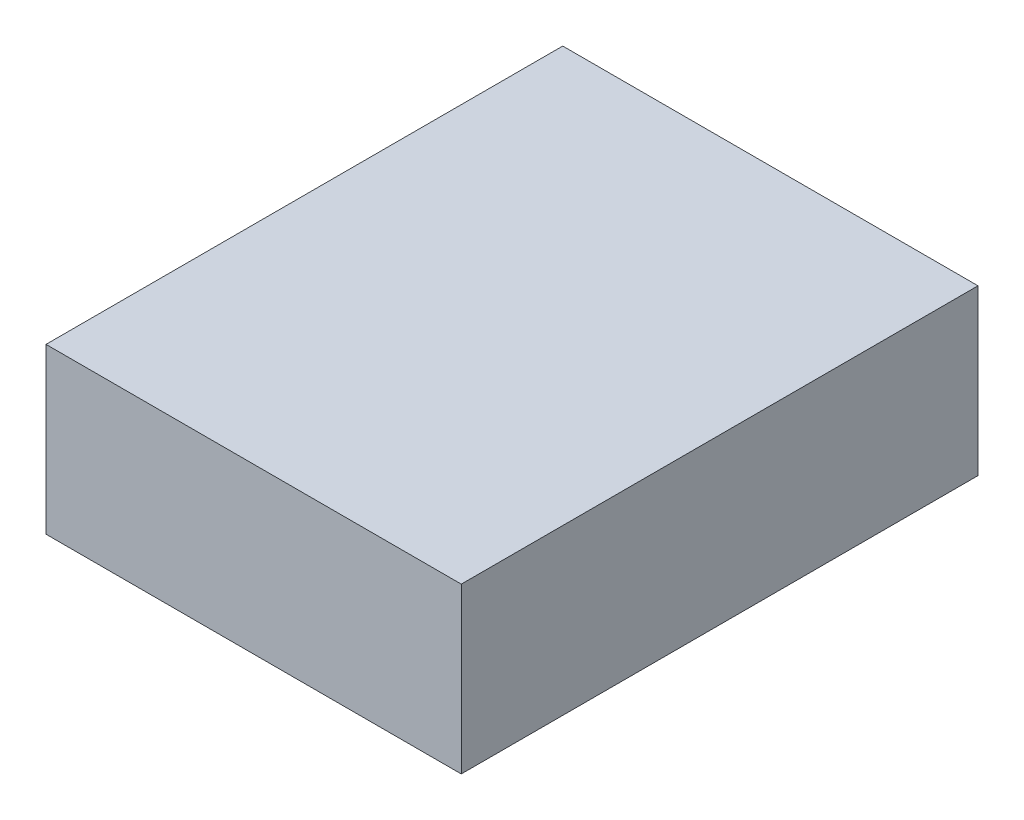
ISO-10303-21;
HEADER;
FILE_DESCRIPTION(('STEP AP214'),'2;1');
FILE_NAME('part.step','',(''),(''),'','','');
FILE_SCHEMA(('AUTOMOTIVE_DESIGN { 1 0 10303 214 1 1 1 1 }'));
ENDSEC;
DATA;
#1=APPLICATION_CONTEXT('core data for automotive mechanical design processes');
#2=APPLICATION_PROTOCOL_DEFINITION('international standard','automotive_design',2000,#1);
#3=PRODUCT_CONTEXT('',#1,'mechanical');
#4=PRODUCT('Part','Part','',(#3));
#5=PRODUCT_RELATED_PRODUCT_CATEGORY('part','',(#4));
#6=PRODUCT_DEFINITION_FORMATION('','',#4);
#7=PRODUCT_DEFINITION_CONTEXT('part definition',#1,'design');
#8=PRODUCT_DEFINITION('design','',#6,#7);
#9=PRODUCT_DEFINITION_SHAPE('','',#8);
#10=(LENGTH_UNIT() NAMED_UNIT(*) SI_UNIT(.MILLI.,.METRE.));
#11=(NAMED_UNIT(*) PLANE_ANGLE_UNIT() SI_UNIT($,.RADIAN.));
#12=(NAMED_UNIT(*) SI_UNIT($,.STERADIAN.) SOLID_ANGLE_UNIT());
#13=UNCERTAINTY_MEASURE_WITH_UNIT(LENGTH_MEASURE(1.E-05),#10,'distance_accuracy_value','');
#14=(GEOMETRIC_REPRESENTATION_CONTEXT(3) GLOBAL_UNCERTAINTY_ASSIGNED_CONTEXT((#13)) GLOBAL_UNIT_ASSIGNED_CONTEXT((#10,
#11,#12)) REPRESENTATION_CONTEXT('',''));
#15=CARTESIAN_POINT('',(0.,0.,0.));
#16=DIRECTION('',(0.,0.,1.));
#17=DIRECTION('',(1.,0.,0.));
#18=AXIS2_PLACEMENT_3D('',#15,#16,#17);
#19=CARTESIAN_POINT('',(0.,175.,0.));
#20=DIRECTION('',(1.,0.,0.));
#21=DIRECTION('',(0.,0.,-1.));
#22=AXIS2_PLACEMENT_3D('',#19,#20,#21);
#23=PLANE('',#22);
#24=DIRECTION('',(0.,0.,1.));
#25=VECTOR('',#24,1.);
#26=CARTESIAN_POINT('',(0.,0.,0.));
#27=LINE('',#26,#25);
#28=CARTESIAN_POINT('',(0.,0.,-550.));
#29=VERTEX_POINT('',#28);
#30=CARTESIAN_POINT('',(0.,0.,0.));
#31=VERTEX_POINT('',#30);
#32=EDGE_CURVE('E98',#29,#31,#27,.T.);
#33=ORIENTED_EDGE('',*,*,#32,.T.);
#34=DIRECTION('',(0.,-1.,0.));
#35=VECTOR('',#34,1.);
#36=CARTESIAN_POINT('',(0.,175.,0.));
#37=LINE('',#36,#35);
#38=CARTESIAN_POINT('',(0.,175.,0.));
#39=VERTEX_POINT('',#38);
#40=EDGE_CURVE('E11',#39,#31,#37,.T.);
#41=ORIENTED_EDGE('',*,*,#40,.F.);
#42=DIRECTION('',(0.,0.,1.));
#43=VECTOR('',#42,1.);
#44=CARTESIAN_POINT('',(0.,175.,0.));
#45=LINE('',#44,#43);
#46=CARTESIAN_POINT('',(0.,175.,-550.));
#47=VERTEX_POINT('',#46);
#48=EDGE_CURVE('E86',#47,#39,#45,.T.);
#49=ORIENTED_EDGE('',*,*,#48,.F.);
#50=DIRECTION('',(0.,-1.,0.));
#51=VECTOR('',#50,1.);
#52=CARTESIAN_POINT('',(0.,175.,-550.));
#53=LINE('',#52,#51);
#54=EDGE_CURVE('E94',#47,#29,#53,.T.);
#55=ORIENTED_EDGE('',*,*,#54,.T.);
#56=EDGE_LOOP('',(#33,#41,#49,#55));
#57=FACE_BOUND('',#56,.T.);
#58=ADVANCED_FACE('F35',(#57),#23,.F.);
#59=CARTESIAN_POINT('',(0.,175.,0.));
#60=DIRECTION('',(0.,0.,-1.));
#61=DIRECTION('',(-1.,0.,0.));
#62=AXIS2_PLACEMENT_3D('',#59,#60,#61);
#63=PLANE('',#62);
#64=DIRECTION('',(1.,0.,0.));
#65=VECTOR('',#64,1.);
#66=CARTESIAN_POINT('',(0.,0.,0.));
#67=LINE('',#66,#65);
#68=CARTESIAN_POINT('',(442.,0.,0.));
#69=VERTEX_POINT('',#68);
#70=EDGE_CURVE('E90',#31,#69,#67,.T.);
#71=ORIENTED_EDGE('',*,*,#70,.T.);
#72=DIRECTION('',(0.,-1.,0.));
#73=VECTOR('',#72,1.);
#74=CARTESIAN_POINT('',(442.,175.,0.));
#75=LINE('',#74,#73);
#76=CARTESIAN_POINT('',(442.,175.,0.));
#77=VERTEX_POINT('',#76);
#78=EDGE_CURVE('E43',#77,#69,#75,.T.);
#79=ORIENTED_EDGE('',*,*,#78,.F.);
#80=DIRECTION('',(1.,0.,0.));
#81=VECTOR('',#80,1.);
#82=CARTESIAN_POINT('',(0.,175.,0.));
#83=LINE('',#82,#81);
#84=EDGE_CURVE('E81',#39,#77,#83,.T.);
#85=ORIENTED_EDGE('',*,*,#84,.F.);
#86=ORIENTED_EDGE('',*,*,#40,.T.);
#87=EDGE_LOOP('',(#71,#79,#85,#86));
#88=FACE_BOUND('',#87,.T.);
#89=ADVANCED_FACE('F89',(#88),#63,.F.);
#90=CARTESIAN_POINT('',(442.,175.,0.));
#91=DIRECTION('',(-1.,0.,0.));
#92=DIRECTION('',(0.,0.,1.));
#93=AXIS2_PLACEMENT_3D('',#90,#91,#92);
#94=PLANE('',#93);
#95=DIRECTION('',(0.,0.,-1.));
#96=VECTOR('',#95,1.);
#97=CARTESIAN_POINT('',(442.,0.,0.));
#98=LINE('',#97,#96);
#99=CARTESIAN_POINT('',(442.,0.,-550.));
#100=VERTEX_POINT('',#99);
#101=EDGE_CURVE('E68',#69,#100,#98,.T.);
#102=ORIENTED_EDGE('',*,*,#101,.T.);
#103=DIRECTION('',(0.,-1.,0.));
#104=VECTOR('',#103,1.);
#105=CARTESIAN_POINT('',(442.,175.,-550.));
#106=LINE('',#105,#104);
#107=CARTESIAN_POINT('',(442.,175.,-550.));
#108=VERTEX_POINT('',#107);
#109=EDGE_CURVE('E91',#108,#100,#106,.T.);
#110=ORIENTED_EDGE('',*,*,#109,.F.);
#111=DIRECTION('',(0.,0.,-1.));
#112=VECTOR('',#111,1.);
#113=CARTESIAN_POINT('',(442.,175.,0.));
#114=LINE('',#113,#112);
#115=EDGE_CURVE('E84',#77,#108,#114,.T.);
#116=ORIENTED_EDGE('',*,*,#115,.F.);
#117=ORIENTED_EDGE('',*,*,#78,.T.);
#118=EDGE_LOOP('',(#102,#110,#116,#117));
#119=FACE_BOUND('',#118,.T.);
#120=ADVANCED_FACE('F92',(#119),#94,.F.);
#121=CARTESIAN_POINT('',(0.,175.,-550.));
#122=DIRECTION('',(0.,0.,1.));
#123=DIRECTION('',(1.,0.,0.));
#124=AXIS2_PLACEMENT_3D('',#121,#122,#123);
#125=PLANE('',#124);
#126=DIRECTION('',(-1.,0.,0.));
#127=VECTOR('',#126,1.);
#128=CARTESIAN_POINT('',(0.,0.,-550.));
#129=LINE('',#128,#127);
#130=EDGE_CURVE('E74',#100,#29,#129,.T.);
#131=ORIENTED_EDGE('',*,*,#130,.T.);
#132=ORIENTED_EDGE('',*,*,#54,.F.);
#133=DIRECTION('',(-1.,0.,0.));
#134=VECTOR('',#133,1.);
#135=CARTESIAN_POINT('',(0.,175.,-550.));
#136=LINE('',#135,#134);
#137=EDGE_CURVE('E51',#108,#47,#136,.T.);
#138=ORIENTED_EDGE('',*,*,#137,.F.);
#139=ORIENTED_EDGE('',*,*,#109,.T.);
#140=EDGE_LOOP('',(#131,#132,#138,#139));
#141=FACE_BOUND('',#140,.T.);
#142=ADVANCED_FACE('F105',(#141),#125,.F.);
#143=CARTESIAN_POINT('',(0.,175.,0.));
#144=DIRECTION('',(0.,-1.,0.));
#145=DIRECTION('',(0.,0.,-1.));
#146=AXIS2_PLACEMENT_3D('',#143,#144,#145);
#147=PLANE('',#146);
#148=ORIENTED_EDGE('',*,*,#48,.T.);
#149=ORIENTED_EDGE('',*,*,#84,.T.);
#150=ORIENTED_EDGE('',*,*,#115,.T.);
#151=ORIENTED_EDGE('',*,*,#137,.T.);
#152=EDGE_LOOP('',(#148,#149,#150,#151));
#153=FACE_BOUND('',#152,.T.);
#154=ADVANCED_FACE('F82',(#153),#147,.F.);
#155=CARTESIAN_POINT('',(0.,0.,0.));
#156=DIRECTION('',(0.,-1.,0.));
#157=DIRECTION('',(0.,0.,-1.));
#158=AXIS2_PLACEMENT_3D('',#155,#156,#157);
#159=PLANE('',#158);
#160=ORIENTED_EDGE('',*,*,#32,.F.);
#161=ORIENTED_EDGE('',*,*,#130,.F.);
#162=ORIENTED_EDGE('',*,*,#101,.F.);
#163=ORIENTED_EDGE('',*,*,#70,.F.);
#164=EDGE_LOOP('',(#160,#161,#162,#163));
#165=FACE_BOUND('',#164,.T.);
#166=ADVANCED_FACE('F108',(#165),#159,.T.);
#167=CLOSED_SHELL('',(#58,#89,#120,#142,#154,#166));
#168=MANIFOLD_SOLID_BREP('B2',#167);
#169=ADVANCED_BREP_SHAPE_REPRESENTATION('',(#18,#168),#14);
#170=SHAPE_DEFINITION_REPRESENTATION(#9,#169);
ENDSEC;
END-ISO-10303-21;
